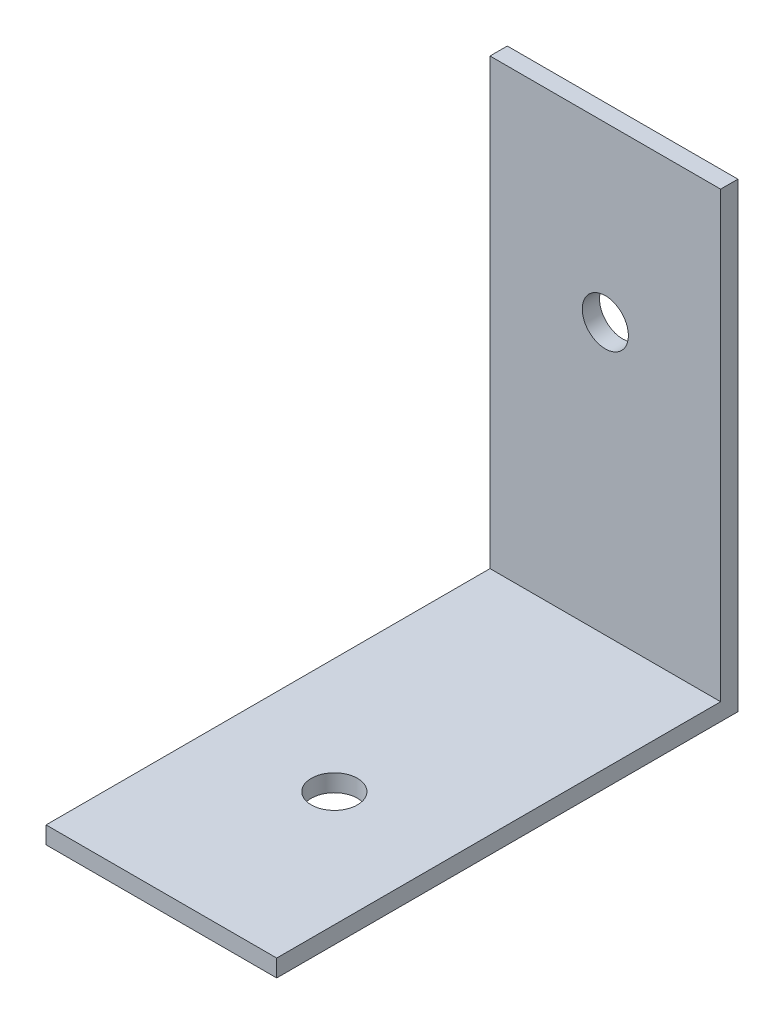
ISO-10303-21;
HEADER;
FILE_DESCRIPTION(('STEP AP214'),'2;1');
FILE_NAME('part.step','',(''),(''),'','','');
FILE_SCHEMA(('AUTOMOTIVE_DESIGN { 1 0 10303 214 1 1 1 1 }'));
ENDSEC;
DATA;
#1=APPLICATION_CONTEXT('core data for automotive mechanical design processes');
#2=APPLICATION_PROTOCOL_DEFINITION('international standard','automotive_design',2000,#1);
#3=PRODUCT_CONTEXT('',#1,'mechanical');
#4=PRODUCT('Part','Part','',(#3));
#5=PRODUCT_RELATED_PRODUCT_CATEGORY('part','',(#4));
#6=PRODUCT_DEFINITION_FORMATION('','',#4);
#7=PRODUCT_DEFINITION_CONTEXT('part definition',#1,'design');
#8=PRODUCT_DEFINITION('design','',#6,#7);
#9=PRODUCT_DEFINITION_SHAPE('','',#8);
#10=(LENGTH_UNIT() NAMED_UNIT(*) SI_UNIT(.MILLI.,.METRE.));
#11=(NAMED_UNIT(*) PLANE_ANGLE_UNIT() SI_UNIT($,.RADIAN.));
#12=(NAMED_UNIT(*) SI_UNIT($,.STERADIAN.) SOLID_ANGLE_UNIT());
#13=UNCERTAINTY_MEASURE_WITH_UNIT(LENGTH_MEASURE(1.E-05),#10,'distance_accuracy_value','');
#14=(GEOMETRIC_REPRESENTATION_CONTEXT(3) GLOBAL_UNCERTAINTY_ASSIGNED_CONTEXT((#13)) GLOBAL_UNIT_ASSIGNED_CONTEXT((#10,
#11,#12)) REPRESENTATION_CONTEXT('',''));
#15=CARTESIAN_POINT('',(0.,0.,0.));
#16=DIRECTION('',(0.,0.,1.));
#17=DIRECTION('',(1.,0.,0.));
#18=AXIS2_PLACEMENT_3D('',#15,#16,#17);
#19=CARTESIAN_POINT('',(0.,1.5,0.));
#20=DIRECTION('',(0.,1.,0.));
#21=DIRECTION('',(0.,0.,1.));
#22=AXIS2_PLACEMENT_3D('',#19,#20,#21);
#23=PLANE('',#22);
#24=DIRECTION('',(1.,0.,0.));
#25=VECTOR('',#24,1.);
#26=CARTESIAN_POINT('',(-10.,1.5,-18.5));
#27=LINE('',#26,#25);
#28=CARTESIAN_POINT('',(-10.,1.5,-18.5));
#29=VERTEX_POINT('',#28);
#30=CARTESIAN_POINT('',(10.,1.5,-18.5));
#31=VERTEX_POINT('',#30);
#32=EDGE_CURVE('E63',#29,#31,#27,.T.);
#33=ORIENTED_EDGE('',*,*,#32,.F.);
#34=DIRECTION('',(0.,0.,1.));
#35=VECTOR('',#34,1.);
#36=CARTESIAN_POINT('',(-10.,1.5,-20.));
#37=LINE('',#36,#35);
#38=CARTESIAN_POINT('',(-10.,1.5,20.));
#39=VERTEX_POINT('',#38);
#40=EDGE_CURVE('E166',#29,#39,#37,.T.);
#41=ORIENTED_EDGE('',*,*,#40,.T.);
#42=DIRECTION('',(1.,0.,0.));
#43=VECTOR('',#42,1.);
#44=CARTESIAN_POINT('',(-10.,1.5,20.));
#45=LINE('',#44,#43);
#46=CARTESIAN_POINT('',(10.,1.5,20.));
#47=VERTEX_POINT('',#46);
#48=EDGE_CURVE('E69',#39,#47,#45,.T.);
#49=ORIENTED_EDGE('',*,*,#48,.T.);
#50=DIRECTION('',(0.,0.,-1.));
#51=VECTOR('',#50,1.);
#52=CARTESIAN_POINT('',(10.,1.5,-20.));
#53=LINE('',#52,#51);
#54=EDGE_CURVE('E98',#47,#31,#53,.T.);
#55=ORIENTED_EDGE('',*,*,#54,.T.);
#56=EDGE_LOOP('',(#33,#41,#49,#55));
#57=FACE_BOUND('',#56,.T.);
#58=CARTESIAN_POINT('',(0.,1.5,5.));
#59=DIRECTION('',(0.,1.,0.));
#60=DIRECTION('',(0.,0.,1.));
#61=AXIS2_PLACEMENT_3D('',#58,#59,#60);
#62=CIRCLE('',#61,2.);
#63=CARTESIAN_POINT('',(0.,1.5,7.));
#64=VERTEX_POINT('',#63);
#65=EDGE_CURVE('E110',#64,#64,#62,.T.);
#66=ORIENTED_EDGE('',*,*,#65,.F.);
#67=EDGE_LOOP('',(#66));
#68=FACE_BOUND('',#67,.T.);
#69=ADVANCED_FACE('F48',(#57,#68),#23,.T.);
#70=CARTESIAN_POINT('',(0.,0.,0.));
#71=DIRECTION('',(0.,1.,0.));
#72=DIRECTION('',(0.,0.,1.));
#73=AXIS2_PLACEMENT_3D('',#70,#71,#72);
#74=PLANE('',#73);
#75=DIRECTION('',(0.,0.,-1.));
#76=VECTOR('',#75,1.);
#77=CARTESIAN_POINT('',(10.,0.,-20.));
#78=LINE('',#77,#76);
#79=CARTESIAN_POINT('',(10.,0.,20.));
#80=VERTEX_POINT('',#79);
#81=CARTESIAN_POINT('',(10.,0.,-20.));
#82=VERTEX_POINT('',#81);
#83=EDGE_CURVE('E104',#80,#82,#78,.T.);
#84=ORIENTED_EDGE('',*,*,#83,.F.);
#85=DIRECTION('',(1.,0.,0.));
#86=VECTOR('',#85,1.);
#87=CARTESIAN_POINT('',(-10.,0.,20.));
#88=LINE('',#87,#86);
#89=CARTESIAN_POINT('',(-10.,0.,20.));
#90=VERTEX_POINT('',#89);
#91=EDGE_CURVE('E88',#90,#80,#88,.T.);
#92=ORIENTED_EDGE('',*,*,#91,.F.);
#93=DIRECTION('',(0.,0.,1.));
#94=VECTOR('',#93,1.);
#95=CARTESIAN_POINT('',(-10.,0.,-20.));
#96=LINE('',#95,#94);
#97=CARTESIAN_POINT('',(-10.,0.,-20.));
#98=VERTEX_POINT('',#97);
#99=EDGE_CURVE('E99',#98,#90,#96,.T.);
#100=ORIENTED_EDGE('',*,*,#99,.F.);
#101=DIRECTION('',(-1.,0.,0.));
#102=VECTOR('',#101,1.);
#103=CARTESIAN_POINT('',(-10.,0.,-20.));
#104=LINE('',#103,#102);
#105=EDGE_CURVE('E109',#82,#98,#104,.T.);
#106=ORIENTED_EDGE('',*,*,#105,.F.);
#107=EDGE_LOOP('',(#84,#92,#100,#106));
#108=FACE_BOUND('',#107,.T.);
#109=CARTESIAN_POINT('',(0.,0.,5.));
#110=DIRECTION('',(0.,1.,0.));
#111=DIRECTION('',(0.,0.,1.));
#112=AXIS2_PLACEMENT_3D('',#109,#110,#111);
#113=CIRCLE('',#112,2.);
#114=CARTESIAN_POINT('',(0.,0.,7.));
#115=VERTEX_POINT('',#114);
#116=EDGE_CURVE('E114',#115,#115,#113,.T.);
#117=ORIENTED_EDGE('',*,*,#116,.T.);
#118=EDGE_LOOP('',(#117));
#119=FACE_BOUND('',#118,.T.);
#120=ADVANCED_FACE('F107',(#108,#119),#74,.F.);
#121=CARTESIAN_POINT('',(10.,1.5,-20.));
#122=DIRECTION('',(-1.,0.,0.));
#123=DIRECTION('',(0.,0.,1.));
#124=AXIS2_PLACEMENT_3D('',#121,#122,#123);
#125=PLANE('',#124);
#126=ORIENTED_EDGE('',*,*,#83,.T.);
#127=DIRECTION('',(0.,-1.,0.));
#128=VECTOR('',#127,1.);
#129=CARTESIAN_POINT('',(10.,1.5,-20.));
#130=LINE('',#129,#128);
#131=CARTESIAN_POINT('',(10.,40.,-20.));
#132=VERTEX_POINT('',#131);
#133=EDGE_CURVE('E13',#132,#82,#130,.T.);
#134=ORIENTED_EDGE('',*,*,#133,.F.);
#135=DIRECTION('',(0.,0.,1.));
#136=VECTOR('',#135,1.);
#137=CARTESIAN_POINT('',(10.,40.,-20.));
#138=LINE('',#137,#136);
#139=CARTESIAN_POINT('',(10.,40.,-18.5));
#140=VERTEX_POINT('',#139);
#141=EDGE_CURVE('E151',#132,#140,#138,.T.);
#142=ORIENTED_EDGE('',*,*,#141,.T.);
#143=DIRECTION('',(0.,-1.,0.));
#144=VECTOR('',#143,1.);
#145=CARTESIAN_POINT('',(10.,40.,-18.5));
#146=LINE('',#145,#144);
#147=EDGE_CURVE('E153',#140,#31,#146,.T.);
#148=ORIENTED_EDGE('',*,*,#147,.T.);
#149=ORIENTED_EDGE('',*,*,#54,.F.);
#150=DIRECTION('',(0.,-1.,0.));
#151=VECTOR('',#150,1.);
#152=CARTESIAN_POINT('',(10.,1.5,20.));
#153=LINE('',#152,#151);
#154=EDGE_CURVE('E91',#47,#80,#153,.T.);
#155=ORIENTED_EDGE('',*,*,#154,.T.);
#156=EDGE_LOOP('',(#126,#134,#142,#148,#149,#155));
#157=FACE_BOUND('',#156,.T.);
#158=ADVANCED_FACE('F50',(#157),#125,.F.);
#159=CARTESIAN_POINT('',(-10.,1.5,-20.));
#160=DIRECTION('',(0.,0.,1.));
#161=DIRECTION('',(1.,0.,0.));
#162=AXIS2_PLACEMENT_3D('',#159,#160,#161);
#163=PLANE('',#162);
#164=CARTESIAN_POINT('',(0.,25.,-20.));
#165=DIRECTION('',(0.,0.,-1.));
#166=DIRECTION('',(-1.,0.,0.));
#167=AXIS2_PLACEMENT_3D('',#164,#165,#166);
#168=CIRCLE('',#167,2.);
#169=CARTESIAN_POINT('',(-2.,25.,-20.));
#170=VERTEX_POINT('',#169);
#171=EDGE_CURVE('E192',#170,#170,#168,.T.);
#172=ORIENTED_EDGE('',*,*,#171,.F.);
#173=EDGE_LOOP('',(#172));
#174=FACE_BOUND('',#173,.T.);
#175=ORIENTED_EDGE('',*,*,#105,.T.);
#176=DIRECTION('',(0.,-1.,0.));
#177=VECTOR('',#176,1.);
#178=CARTESIAN_POINT('',(-10.,1.5,-20.));
#179=LINE('',#178,#177);
#180=CARTESIAN_POINT('',(-10.,40.,-20.));
#181=VERTEX_POINT('',#180);
#182=EDGE_CURVE('E56',#181,#98,#179,.T.);
#183=ORIENTED_EDGE('',*,*,#182,.F.);
#184=DIRECTION('',(1.,0.,0.));
#185=VECTOR('',#184,1.);
#186=CARTESIAN_POINT('',(-10.,40.,-20.));
#187=LINE('',#186,#185);
#188=EDGE_CURVE('E133',#181,#132,#187,.T.);
#189=ORIENTED_EDGE('',*,*,#188,.T.);
#190=ORIENTED_EDGE('',*,*,#133,.T.);
#191=EDGE_LOOP('',(#175,#183,#189,#190));
#192=FACE_BOUND('',#191,.T.);
#193=ADVANCED_FACE('F131',(#174,#192),#163,.F.);
#194=CARTESIAN_POINT('',(-10.,1.5,-20.));
#195=DIRECTION('',(1.,0.,0.));
#196=DIRECTION('',(0.,0.,-1.));
#197=AXIS2_PLACEMENT_3D('',#194,#195,#196);
#198=PLANE('',#197);
#199=ORIENTED_EDGE('',*,*,#99,.T.);
#200=DIRECTION('',(0.,-1.,0.));
#201=VECTOR('',#200,1.);
#202=CARTESIAN_POINT('',(-10.,1.5,20.));
#203=LINE('',#202,#201);
#204=EDGE_CURVE('E94',#39,#90,#203,.T.);
#205=ORIENTED_EDGE('',*,*,#204,.F.);
#206=ORIENTED_EDGE('',*,*,#40,.F.);
#207=DIRECTION('',(0.,-1.,0.));
#208=VECTOR('',#207,1.);
#209=CARTESIAN_POINT('',(-10.,40.,-18.5));
#210=LINE('',#209,#208);
#211=CARTESIAN_POINT('',(-10.,40.,-18.5));
#212=VERTEX_POINT('',#211);
#213=EDGE_CURVE('E155',#212,#29,#210,.T.);
#214=ORIENTED_EDGE('',*,*,#213,.F.);
#215=DIRECTION('',(0.,0.,1.));
#216=VECTOR('',#215,1.);
#217=CARTESIAN_POINT('',(-10.,40.,-20.));
#218=LINE('',#217,#216);
#219=EDGE_CURVE('E127',#181,#212,#218,.T.);
#220=ORIENTED_EDGE('',*,*,#219,.F.);
#221=ORIENTED_EDGE('',*,*,#182,.T.);
#222=EDGE_LOOP('',(#199,#205,#206,#214,#220,#221));
#223=FACE_BOUND('',#222,.T.);
#224=ADVANCED_FACE('F124',(#223),#198,.F.);
#225=CARTESIAN_POINT('',(-10.,1.5,20.));
#226=DIRECTION('',(0.,0.,-1.));
#227=DIRECTION('',(-1.,0.,0.));
#228=AXIS2_PLACEMENT_3D('',#225,#226,#227);
#229=PLANE('',#228);
#230=ORIENTED_EDGE('',*,*,#91,.T.);
#231=ORIENTED_EDGE('',*,*,#154,.F.);
#232=ORIENTED_EDGE('',*,*,#48,.F.);
#233=ORIENTED_EDGE('',*,*,#204,.T.);
#234=EDGE_LOOP('',(#230,#231,#232,#233));
#235=FACE_BOUND('',#234,.T.);
#236=ADVANCED_FACE('F90',(#235),#229,.F.);
#237=CARTESIAN_POINT('',(0.,1.5,5.));
#238=DIRECTION('',(0.,-1.,0.));
#239=DIRECTION('',(0.,0.,-1.));
#240=AXIS2_PLACEMENT_3D('',#237,#238,#239);
#241=CYLINDRICAL_SURFACE('',#240,2.);
#242=ORIENTED_EDGE('',*,*,#65,.T.);
#243=EDGE_LOOP('',(#242));
#244=FACE_BOUND('',#243,.T.);
#245=ORIENTED_EDGE('',*,*,#116,.F.);
#246=EDGE_LOOP('',(#245));
#247=FACE_BOUND('',#246,.T.);
#248=ADVANCED_FACE('F172',(#244,#247),#241,.F.);
#249=CARTESIAN_POINT('',(-10.,40.,-18.5));
#250=DIRECTION('',(0.,0.,-1.));
#251=DIRECTION('',(-1.,0.,0.));
#252=AXIS2_PLACEMENT_3D('',#249,#250,#251);
#253=PLANE('',#252);
#254=CARTESIAN_POINT('',(0.,25.,-18.5));
#255=DIRECTION('',(0.,0.,-1.));
#256=DIRECTION('',(-1.,0.,0.));
#257=AXIS2_PLACEMENT_3D('',#254,#255,#256);
#258=CIRCLE('',#257,2.);
#259=CARTESIAN_POINT('',(-2.,25.,-18.5));
#260=VERTEX_POINT('',#259);
#261=EDGE_CURVE('E161',#260,#260,#258,.F.);
#262=ORIENTED_EDGE('',*,*,#261,.F.);
#263=EDGE_LOOP('',(#262));
#264=FACE_BOUND('',#263,.T.);
#265=ORIENTED_EDGE('',*,*,#32,.T.);
#266=ORIENTED_EDGE('',*,*,#147,.F.);
#267=DIRECTION('',(1.,0.,0.));
#268=VECTOR('',#267,1.);
#269=CARTESIAN_POINT('',(-10.,40.,-18.5));
#270=LINE('',#269,#268);
#271=EDGE_CURVE('E146',#212,#140,#270,.T.);
#272=ORIENTED_EDGE('',*,*,#271,.F.);
#273=ORIENTED_EDGE('',*,*,#213,.T.);
#274=EDGE_LOOP('',(#265,#266,#272,#273));
#275=FACE_BOUND('',#274,.T.);
#276=ADVANCED_FACE('F154',(#264,#275),#253,.F.);
#277=CARTESIAN_POINT('',(0.,40.,0.));
#278=DIRECTION('',(0.,1.,0.));
#279=DIRECTION('',(0.,0.,1.));
#280=AXIS2_PLACEMENT_3D('',#277,#278,#279);
#281=PLANE('',#280);
#282=ORIENTED_EDGE('',*,*,#219,.T.);
#283=ORIENTED_EDGE('',*,*,#271,.T.);
#284=ORIENTED_EDGE('',*,*,#141,.F.);
#285=ORIENTED_EDGE('',*,*,#188,.F.);
#286=EDGE_LOOP('',(#282,#283,#284,#285));
#287=FACE_BOUND('',#286,.T.);
#288=ADVANCED_FACE('F149',(#287),#281,.T.);
#289=CARTESIAN_POINT('',(0.,25.,-12.8431457505076));
#290=DIRECTION('',(0.,0.,-1.));
#291=DIRECTION('',(-1.,0.,0.));
#292=AXIS2_PLACEMENT_3D('',#289,#290,#291);
#293=CYLINDRICAL_SURFACE('',#292,2.);
#294=ORIENTED_EDGE('',*,*,#261,.T.);
#295=EDGE_LOOP('',(#294));
#296=FACE_BOUND('',#295,.T.);
#297=ORIENTED_EDGE('',*,*,#171,.T.);
#298=EDGE_LOOP('',(#297));
#299=FACE_BOUND('',#298,.T.);
#300=ADVANCED_FACE('F199',(#296,#299),#293,.F.);
#301=CLOSED_SHELL('',(#69,#120,#158,#193,#224,#236,#248,#276,#288,#300));
#302=MANIFOLD_SOLID_BREP('B2',#301);
#303=ADVANCED_BREP_SHAPE_REPRESENTATION('',(#18,#302),#14);
#304=SHAPE_DEFINITION_REPRESENTATION(#9,#303);
ENDSEC;
END-ISO-10303-21;
